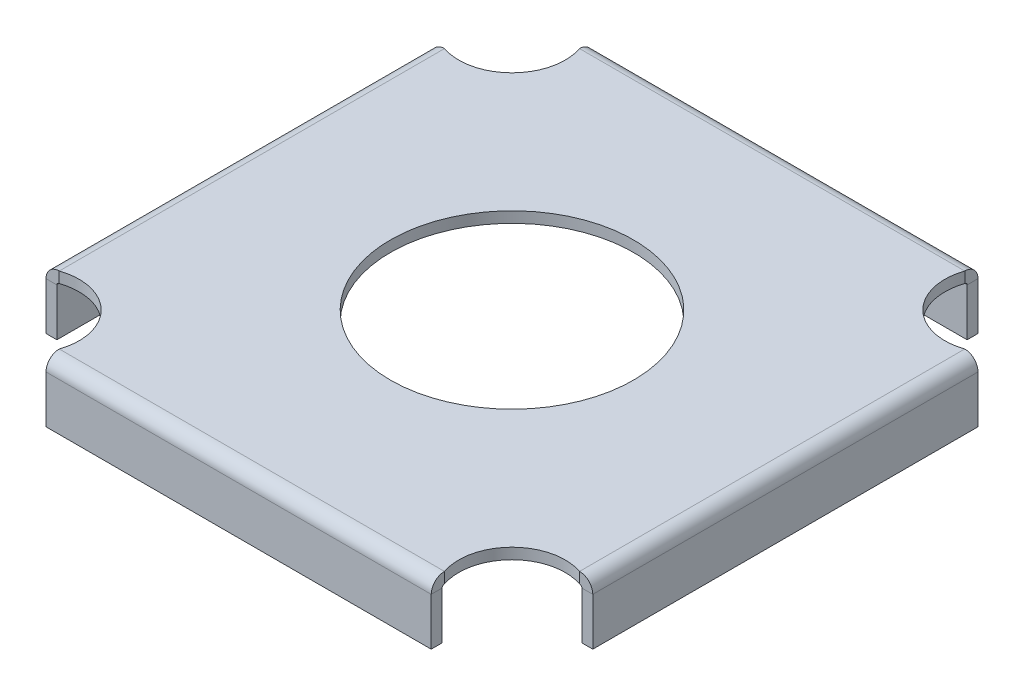
ISO-10303-21;
HEADER;
FILE_DESCRIPTION(('STEP AP214'),'2;1');
FILE_NAME('part.step','',(''),(''),'','','');
FILE_SCHEMA(('AUTOMOTIVE_DESIGN { 1 0 10303 214 1 1 1 1 }'));
ENDSEC;
DATA;
#1=APPLICATION_CONTEXT('core data for automotive mechanical design processes');
#2=APPLICATION_PROTOCOL_DEFINITION('international standard','automotive_design',2000,#1);
#3=PRODUCT_CONTEXT('',#1,'mechanical');
#4=PRODUCT('Part','Part','',(#3));
#5=PRODUCT_RELATED_PRODUCT_CATEGORY('part','',(#4));
#6=PRODUCT_DEFINITION_FORMATION('','',#4);
#7=PRODUCT_DEFINITION_CONTEXT('part definition',#1,'design');
#8=PRODUCT_DEFINITION('design','',#6,#7);
#9=PRODUCT_DEFINITION_SHAPE('','',#8);
#10=(LENGTH_UNIT() NAMED_UNIT(*) SI_UNIT(.MILLI.,.METRE.));
#11=(NAMED_UNIT(*) PLANE_ANGLE_UNIT() SI_UNIT($,.RADIAN.));
#12=(NAMED_UNIT(*) SI_UNIT($,.STERADIAN.) SOLID_ANGLE_UNIT());
#13=UNCERTAINTY_MEASURE_WITH_UNIT(LENGTH_MEASURE(1.E-05),#10,'distance_accuracy_value','');
#14=(GEOMETRIC_REPRESENTATION_CONTEXT(3) GLOBAL_UNCERTAINTY_ASSIGNED_CONTEXT((#13)) GLOBAL_UNIT_ASSIGNED_CONTEXT((#10,
#11,#12)) REPRESENTATION_CONTEXT('',''));
#15=CARTESIAN_POINT('',(0.,0.,0.));
#16=DIRECTION('',(0.,0.,1.));
#17=DIRECTION('',(1.,0.,0.));
#18=AXIS2_PLACEMENT_3D('',#15,#16,#17);
#19=CARTESIAN_POINT('',(76.2,-3.4163,76.2));
#20=DIRECTION('',(0.,1.,0.));
#21=DIRECTION('',(0.,0.,1.));
#22=AXIS2_PLACEMENT_3D('',#19,#20,#21);
#23=CYLINDRICAL_SURFACE('',#22,16.7005);
#24=CARTESIAN_POINT('',(76.2,0.,76.2));
#25=DIRECTION('',(0.,-1.,0.));
#26=DIRECTION('',(0.,0.,1.));
#27=AXIS2_PLACEMENT_3D('',#24,#25,#26);
#28=CIRCLE('',#27,16.7005);
#29=CARTESIAN_POINT('',(60.3828089759907,0.,81.5594));
#30=VERTEX_POINT('',#29);
#31=CARTESIAN_POINT('',(81.5594,0.,60.3828089759907));
#32=VERTEX_POINT('',#31);
#33=EDGE_CURVE('E538',#30,#32,#28,.T.);
#34=ORIENTED_EDGE('',*,*,#33,.F.);
#35=DIRECTION('',(0.,1.,0.));
#36=VECTOR('',#35,1.);
#37=CARTESIAN_POINT('',(60.3828089759907,-3.4163,81.5594));
#38=LINE('',#37,#36);
#39=CARTESIAN_POINT('',(60.3828089759907,-3.41629999999999,81.5594));
#40=VERTEX_POINT('',#39);
#41=EDGE_CURVE('E13',#40,#30,#38,.T.);
#42=ORIENTED_EDGE('',*,*,#41,.F.);
#43=CARTESIAN_POINT('',(76.2,-3.4163,76.2));
#44=DIRECTION('',(0.,-1.,0.));
#45=DIRECTION('',(0.,0.,1.));
#46=AXIS2_PLACEMENT_3D('',#43,#44,#45);
#47=CIRCLE('',#46,16.7005);
#48=CARTESIAN_POINT('',(81.5594,-3.4163,60.3828089759907));
#49=VERTEX_POINT('',#48);
#50=EDGE_CURVE('E542',#40,#49,#47,.T.);
#51=ORIENTED_EDGE('',*,*,#50,.T.);
#52=DIRECTION('',(0.,1.,0.));
#53=VECTOR('',#52,1.);
#54=CARTESIAN_POINT('',(81.5594,-3.4163,60.3828089759907));
#55=LINE('',#54,#53);
#56=EDGE_CURVE('E130',#49,#32,#55,.T.);
#57=ORIENTED_EDGE('',*,*,#56,.T.);
#58=EDGE_LOOP('',(#34,#42,#51,#57));
#59=FACE_BOUND('',#58,.T.);
#60=ADVANCED_FACE('F127',(#59),#23,.F.);
#61=CARTESIAN_POINT('',(-76.2,-3.4163,76.2));
#62=DIRECTION('',(0.,1.,0.));
#63=DIRECTION('',(0.,0.,1.));
#64=AXIS2_PLACEMENT_3D('',#61,#62,#63);
#65=CYLINDRICAL_SURFACE('',#64,16.7005);
#66=CARTESIAN_POINT('',(-76.2,0.,76.2));
#67=DIRECTION('',(0.,-1.,0.));
#68=DIRECTION('',(0.,0.,1.));
#69=AXIS2_PLACEMENT_3D('',#66,#67,#68);
#70=CIRCLE('',#69,16.7005);
#71=CARTESIAN_POINT('',(-81.5594,0.,60.3828089759907));
#72=VERTEX_POINT('',#71);
#73=CARTESIAN_POINT('',(-60.3828089759907,0.,81.5594));
#74=VERTEX_POINT('',#73);
#75=EDGE_CURVE('E594',#72,#74,#70,.T.);
#76=ORIENTED_EDGE('',*,*,#75,.F.);
#77=DIRECTION('',(0.,1.,0.));
#78=VECTOR('',#77,1.);
#79=CARTESIAN_POINT('',(-81.5594,-3.4163,60.3828089759907));
#80=LINE('',#79,#78);
#81=CARTESIAN_POINT('',(-81.5594,-3.4163,60.3828089759907));
#82=VERTEX_POINT('',#81);
#83=EDGE_CURVE('E604',#82,#72,#80,.T.);
#84=ORIENTED_EDGE('',*,*,#83,.F.);
#85=CARTESIAN_POINT('',(-76.2,-3.4163,76.2));
#86=DIRECTION('',(0.,-1.,0.));
#87=DIRECTION('',(0.,0.,1.));
#88=AXIS2_PLACEMENT_3D('',#85,#86,#87);
#89=CIRCLE('',#88,16.7005);
#90=CARTESIAN_POINT('',(-60.3828089759907,-3.41629999999999,81.5594));
#91=VERTEX_POINT('',#90);
#92=EDGE_CURVE('E564',#82,#91,#89,.T.);
#93=ORIENTED_EDGE('',*,*,#92,.T.);
#94=DIRECTION('',(0.,1.,0.));
#95=VECTOR('',#94,1.);
#96=CARTESIAN_POINT('',(-60.3828089759907,-3.4163,81.5594));
#97=LINE('',#96,#95);
#98=EDGE_CURVE('E136',#91,#74,#97,.T.);
#99=ORIENTED_EDGE('',*,*,#98,.T.);
#100=EDGE_LOOP('',(#76,#84,#93,#99));
#101=FACE_BOUND('',#100,.T.);
#102=ADVANCED_FACE('F642',(#101),#65,.F.);
#103=CARTESIAN_POINT('',(-76.2,-3.4163,-76.2));
#104=DIRECTION('',(0.,1.,0.));
#105=DIRECTION('',(0.,0.,1.));
#106=AXIS2_PLACEMENT_3D('',#103,#104,#105);
#107=CYLINDRICAL_SURFACE('',#106,16.7005);
#108=CARTESIAN_POINT('',(-76.2,0.,-76.2));
#109=DIRECTION('',(0.,-1.,0.));
#110=DIRECTION('',(0.,0.,1.));
#111=AXIS2_PLACEMENT_3D('',#108,#109,#110);
#112=CIRCLE('',#111,16.7005);
#113=CARTESIAN_POINT('',(-60.3828089759907,0.,-81.5594));
#114=VERTEX_POINT('',#113);
#115=CARTESIAN_POINT('',(-81.5594,0.,-60.3828089759907));
#116=VERTEX_POINT('',#115);
#117=EDGE_CURVE('E586',#114,#116,#112,.T.);
#118=ORIENTED_EDGE('',*,*,#117,.F.);
#119=DIRECTION('',(0.,1.,0.));
#120=VECTOR('',#119,1.);
#121=CARTESIAN_POINT('',(-60.3828089759907,-3.4163,-81.5594));
#122=LINE('',#121,#120);
#123=CARTESIAN_POINT('',(-60.3828089759907,-3.4163,-81.5594));
#124=VERTEX_POINT('',#123);
#125=EDGE_CURVE('E611',#124,#114,#122,.T.);
#126=ORIENTED_EDGE('',*,*,#125,.F.);
#127=CARTESIAN_POINT('',(-76.2,-3.4163,-76.2));
#128=DIRECTION('',(0.,-1.,0.));
#129=DIRECTION('',(0.,0.,1.));
#130=AXIS2_PLACEMENT_3D('',#127,#128,#129);
#131=CIRCLE('',#130,16.7005);
#132=CARTESIAN_POINT('',(-81.5594,-3.4163,-60.3828089759907));
#133=VERTEX_POINT('',#132);
#134=EDGE_CURVE('E557',#124,#133,#131,.T.);
#135=ORIENTED_EDGE('',*,*,#134,.T.);
#136=DIRECTION('',(0.,1.,0.));
#137=VECTOR('',#136,1.);
#138=CARTESIAN_POINT('',(-81.5594,-3.4163,-60.3828089759907));
#139=LINE('',#138,#137);
#140=EDGE_CURVE('E607',#133,#116,#139,.T.);
#141=ORIENTED_EDGE('',*,*,#140,.T.);
#142=EDGE_LOOP('',(#118,#126,#135,#141));
#143=FACE_BOUND('',#142,.T.);
#144=ADVANCED_FACE('F688',(#143),#107,.F.);
#145=CARTESIAN_POINT('',(76.2,-3.4163,-76.2));
#146=DIRECTION('',(0.,1.,0.));
#147=DIRECTION('',(0.,0.,1.));
#148=AXIS2_PLACEMENT_3D('',#145,#146,#147);
#149=CYLINDRICAL_SURFACE('',#148,16.7005);
#150=CARTESIAN_POINT('',(76.2,0.,-76.2));
#151=DIRECTION('',(0.,-1.,0.));
#152=DIRECTION('',(0.,0.,1.));
#153=AXIS2_PLACEMENT_3D('',#150,#151,#152);
#154=CIRCLE('',#153,16.7005);
#155=CARTESIAN_POINT('',(81.5594,0.,-60.3828089759907));
#156=VERTEX_POINT('',#155);
#157=CARTESIAN_POINT('',(60.3828089759907,0.,-81.5594));
#158=VERTEX_POINT('',#157);
#159=EDGE_CURVE('E578',#156,#158,#154,.T.);
#160=ORIENTED_EDGE('',*,*,#159,.F.);
#161=DIRECTION('',(0.,1.,0.));
#162=VECTOR('',#161,1.);
#163=CARTESIAN_POINT('',(81.5594,-3.4163,-60.3828089759907));
#164=LINE('',#163,#162);
#165=CARTESIAN_POINT('',(81.5594,-3.4163,-60.3828089759907));
#166=VERTEX_POINT('',#165);
#167=EDGE_CURVE('E618',#166,#156,#164,.T.);
#168=ORIENTED_EDGE('',*,*,#167,.F.);
#169=CARTESIAN_POINT('',(76.2,-3.4163,-76.2));
#170=DIRECTION('',(0.,-1.,0.));
#171=DIRECTION('',(0.,0.,1.));
#172=AXIS2_PLACEMENT_3D('',#169,#170,#171);
#173=CIRCLE('',#172,16.7005);
#174=CARTESIAN_POINT('',(60.3828089759907,-3.4163,-81.5594));
#175=VERTEX_POINT('',#174);
#176=EDGE_CURVE('E550',#166,#175,#173,.T.);
#177=ORIENTED_EDGE('',*,*,#176,.T.);
#178=DIRECTION('',(0.,1.,0.));
#179=VECTOR('',#178,1.);
#180=CARTESIAN_POINT('',(60.3828089759907,-3.4163,-81.5594));
#181=LINE('',#180,#179);
#182=EDGE_CURVE('E615',#175,#158,#181,.T.);
#183=ORIENTED_EDGE('',*,*,#182,.T.);
#184=EDGE_LOOP('',(#160,#168,#177,#183));
#185=FACE_BOUND('',#184,.T.);
#186=ADVANCED_FACE('F693',(#185),#149,.F.);
#187=CARTESIAN_POINT('',(76.2,-3.4163,76.2));
#188=DIRECTION('',(0.,1.,0.));
#189=DIRECTION('',(0.,0.,1.));
#190=AXIS2_PLACEMENT_3D('',#187,#188,#189);
#191=PLANE('',#190);
#192=CARTESIAN_POINT('',(0.,-3.4163,0.));
#193=DIRECTION('',(0.,1.,0.));
#194=DIRECTION('',(0.,0.,1.));
#195=AXIS2_PLACEMENT_3D('',#192,#193,#194);
#196=CIRCLE('',#195,38.1);
#197=CARTESIAN_POINT('',(0.,-3.4163,38.1));
#198=VERTEX_POINT('',#197);
#199=EDGE_CURVE('E534',#198,#198,#196,.T.);
#200=ORIENTED_EDGE('',*,*,#199,.T.);
#201=EDGE_LOOP('',(#200));
#202=FACE_BOUND('',#201,.T.);
#203=ORIENTED_EDGE('',*,*,#50,.F.);
#204=DIRECTION('',(1.,0.,0.));
#205=VECTOR('',#204,1.);
#206=CARTESIAN_POINT('',(60.3828089759907,-3.4163,81.5594));
#207=LINE('',#206,#205);
#208=EDGE_CURVE('E568',#91,#40,#207,.T.);
#209=ORIENTED_EDGE('',*,*,#208,.F.);
#210=ORIENTED_EDGE('',*,*,#92,.F.);
#211=DIRECTION('',(0.,0.,1.));
#212=VECTOR('',#211,1.);
#213=CARTESIAN_POINT('',(-81.5594,-3.4163,60.3828089759907));
#214=LINE('',#213,#212);
#215=EDGE_CURVE('E561',#133,#82,#214,.T.);
#216=ORIENTED_EDGE('',*,*,#215,.F.);
#217=ORIENTED_EDGE('',*,*,#134,.F.);
#218=DIRECTION('',(-1.,0.,0.));
#219=VECTOR('',#218,1.);
#220=CARTESIAN_POINT('',(-60.3828089759907,-3.4163,-81.5594));
#221=LINE('',#220,#219);
#222=EDGE_CURVE('E554',#175,#124,#221,.T.);
#223=ORIENTED_EDGE('',*,*,#222,.F.);
#224=ORIENTED_EDGE('',*,*,#176,.F.);
#225=DIRECTION('',(0.,0.,-1.));
#226=VECTOR('',#225,1.);
#227=CARTESIAN_POINT('',(81.5594,-3.4163,-60.3828089759907));
#228=LINE('',#227,#226);
#229=EDGE_CURVE('E546',#49,#166,#228,.T.);
#230=ORIENTED_EDGE('',*,*,#229,.F.);
#231=EDGE_LOOP('',(#203,#209,#210,#216,#217,#223,#224,#230));
#232=FACE_BOUND('',#231,.T.);
#233=ADVANCED_FACE('F648',(#202,#232),#191,.F.);
#234=CARTESIAN_POINT('',(76.2,0.,76.2));
#235=DIRECTION('',(0.,1.,0.));
#236=DIRECTION('',(0.,0.,1.));
#237=AXIS2_PLACEMENT_3D('',#234,#235,#236);
#238=PLANE('',#237);
#239=CARTESIAN_POINT('',(0.,0.,0.));
#240=DIRECTION('',(0.,1.,0.));
#241=DIRECTION('',(0.,0.,1.));
#242=AXIS2_PLACEMENT_3D('',#239,#240,#241);
#243=CIRCLE('',#242,38.1);
#244=CARTESIAN_POINT('',(0.,0.,38.1));
#245=VERTEX_POINT('',#244);
#246=EDGE_CURVE('E522',#245,#245,#243,.T.);
#247=ORIENTED_EDGE('',*,*,#246,.F.);
#248=EDGE_LOOP('',(#247));
#249=FACE_BOUND('',#248,.T.);
#250=ORIENTED_EDGE('',*,*,#33,.T.);
#251=DIRECTION('',(0.,0.,-1.));
#252=VECTOR('',#251,1.);
#253=CARTESIAN_POINT('',(81.5594,0.,-60.3828089759907));
#254=LINE('',#253,#252);
#255=EDGE_CURVE('E574',#32,#156,#254,.T.);
#256=ORIENTED_EDGE('',*,*,#255,.T.);
#257=ORIENTED_EDGE('',*,*,#159,.T.);
#258=DIRECTION('',(-1.,0.,0.));
#259=VECTOR('',#258,1.);
#260=CARTESIAN_POINT('',(-60.3828089759907,0.,-81.5594));
#261=LINE('',#260,#259);
#262=EDGE_CURVE('E582',#158,#114,#261,.T.);
#263=ORIENTED_EDGE('',*,*,#262,.T.);
#264=ORIENTED_EDGE('',*,*,#117,.T.);
#265=DIRECTION('',(0.,0.,1.));
#266=VECTOR('',#265,1.);
#267=CARTESIAN_POINT('',(-81.5594,0.,60.3828089759907));
#268=LINE('',#267,#266);
#269=EDGE_CURVE('E590',#116,#72,#268,.T.);
#270=ORIENTED_EDGE('',*,*,#269,.T.);
#271=ORIENTED_EDGE('',*,*,#75,.T.);
#272=DIRECTION('',(1.,0.,0.));
#273=VECTOR('',#272,1.);
#274=CARTESIAN_POINT('',(60.3828089759907,0.,81.5594));
#275=LINE('',#274,#273);
#276=EDGE_CURVE('E547',#74,#30,#275,.T.);
#277=ORIENTED_EDGE('',*,*,#276,.T.);
#278=EDGE_LOOP('',(#250,#256,#257,#263,#264,#270,#271,#277));
#279=FACE_BOUND('',#278,.T.);
#280=ADVANCED_FACE('F634',(#249,#279),#238,.T.);
#281=CARTESIAN_POINT('',(0.,-3.4163,0.));
#282=DIRECTION('',(0.,1.,0.));
#283=DIRECTION('',(0.,0.,1.));
#284=AXIS2_PLACEMENT_3D('',#281,#282,#283);
#285=CYLINDRICAL_SURFACE('',#284,38.1);
#286=ORIENTED_EDGE('',*,*,#199,.F.);
#287=EDGE_LOOP('',(#286));
#288=FACE_BOUND('',#287,.T.);
#289=ORIENTED_EDGE('',*,*,#246,.T.);
#290=EDGE_LOOP('',(#289));
#291=FACE_BOUND('',#290,.T.);
#292=ADVANCED_FACE('F807',(#288,#291),#285,.F.);
#293=CARTESIAN_POINT('',(60.3828089759907,-4.15289999999999,81.5594));
#294=DIRECTION('',(1.,0.,0.));
#295=DIRECTION('',(0.,0.,-1.));
#296=AXIS2_PLACEMENT_3D('',#293,#294,#295);
#297=PLANE('',#296);
#298=DIRECTION('',(0.,0.,1.));
#299=VECTOR('',#298,1.);
#300=CARTESIAN_POINT('',(60.3828089759907,-4.1529,85.7123));
#301=LINE('',#300,#299);
#302=CARTESIAN_POINT('',(60.3828089759907,-4.15289999999999,82.296));
#303=VERTEX_POINT('',#302);
#304=CARTESIAN_POINT('',(60.3828089759907,-4.15289999999998,85.7123));
#305=VERTEX_POINT('',#304);
#306=EDGE_CURVE('E464',#303,#305,#301,.T.);
#307=ORIENTED_EDGE('',*,*,#306,.F.);
#308=CARTESIAN_POINT('',(60.3828089759907,-4.15289999999999,81.5594));
#309=DIRECTION('',(-1.,0.,0.));
#310=DIRECTION('',(0.,0.,1.));
#311=AXIS2_PLACEMENT_3D('',#308,#309,#310);
#312=CIRCLE('',#311,0.736600000000004);
#313=EDGE_CURVE('E527',#40,#303,#312,.F.);
#314=ORIENTED_EDGE('',*,*,#313,.F.);
#315=ORIENTED_EDGE('',*,*,#41,.T.);
#316=CARTESIAN_POINT('',(60.3828089759907,-4.15289999999999,81.5594));
#317=DIRECTION('',(-1.,0.,0.));
#318=DIRECTION('',(0.,0.,1.));
#319=AXIS2_PLACEMENT_3D('',#316,#317,#318);
#320=CIRCLE('',#319,4.1529);
#321=EDGE_CURVE('E144',#30,#305,#320,.F.);
#322=ORIENTED_EDGE('',*,*,#321,.T.);
#323=EDGE_LOOP('',(#307,#314,#315,#322));
#324=FACE_BOUND('',#323,.T.);
#325=ADVANCED_FACE('F655',(#324),#297,.T.);
#326=CARTESIAN_POINT('',(-60.3828089759907,-4.15289999999999,81.5594));
#327=DIRECTION('',(1.,0.,0.));
#328=DIRECTION('',(0.,0.,-1.));
#329=AXIS2_PLACEMENT_3D('',#326,#327,#328);
#330=PLANE('',#329);
#331=CARTESIAN_POINT('',(-60.3828089759907,-4.15289999999999,81.5594));
#332=DIRECTION('',(-1.,0.,0.));
#333=DIRECTION('',(0.,0.,1.));
#334=AXIS2_PLACEMENT_3D('',#331,#332,#333);
#335=CIRCLE('',#334,0.736600000000004);
#336=CARTESIAN_POINT('',(-60.3828089759907,-4.15289999999999,82.296));
#337=VERTEX_POINT('',#336);
#338=EDGE_CURVE('E479',#337,#91,#335,.T.);
#339=ORIENTED_EDGE('',*,*,#338,.F.);
#340=DIRECTION('',(0.,0.,1.));
#341=VECTOR('',#340,1.);
#342=CARTESIAN_POINT('',(-60.3828089759907,-4.15289999999999,82.296));
#343=LINE('',#342,#341);
#344=CARTESIAN_POINT('',(-60.3828089759907,-4.15289999999999,85.7123));
#345=VERTEX_POINT('',#344);
#346=EDGE_CURVE('E510',#337,#345,#343,.T.);
#347=ORIENTED_EDGE('',*,*,#346,.T.);
#348=CARTESIAN_POINT('',(-60.3828089759907,-4.15289999999999,81.5594));
#349=DIRECTION('',(-1.,0.,0.));
#350=DIRECTION('',(0.,0.,1.));
#351=AXIS2_PLACEMENT_3D('',#348,#349,#350);
#352=CIRCLE('',#351,4.1529);
#353=EDGE_CURVE('E523',#345,#74,#352,.T.);
#354=ORIENTED_EDGE('',*,*,#353,.T.);
#355=ORIENTED_EDGE('',*,*,#98,.F.);
#356=EDGE_LOOP('',(#339,#347,#354,#355));
#357=FACE_BOUND('',#356,.T.);
#358=ADVANCED_FACE('F639',(#357),#330,.F.);
#359=CARTESIAN_POINT('',(-60.3828089759907,-4.15289999999999,81.5594));
#360=DIRECTION('',(-1.,0.,0.));
#361=DIRECTION('',(0.,0.,1.));
#362=AXIS2_PLACEMENT_3D('',#359,#360,#361);
#363=CYLINDRICAL_SURFACE('',#362,4.1529);
#364=ORIENTED_EDGE('',*,*,#276,.F.);
#365=ORIENTED_EDGE('',*,*,#353,.F.);
#366=DIRECTION('',(-1.,0.,0.));
#367=VECTOR('',#366,1.);
#368=CARTESIAN_POINT('',(0.,-4.15289999999999,85.7123));
#369=LINE('',#368,#367);
#370=EDGE_CURVE('E506',#305,#345,#369,.T.);
#371=ORIENTED_EDGE('',*,*,#370,.F.);
#372=ORIENTED_EDGE('',*,*,#321,.F.);
#373=EDGE_LOOP('',(#364,#365,#371,#372));
#374=FACE_BOUND('',#373,.T.);
#375=ADVANCED_FACE('F636',(#374),#363,.T.);
#376=CARTESIAN_POINT('',(-60.3828089759907,-4.15289999999999,81.5594));
#377=DIRECTION('',(-1.,0.,0.));
#378=DIRECTION('',(0.,0.,1.));
#379=AXIS2_PLACEMENT_3D('',#376,#377,#378);
#380=CYLINDRICAL_SURFACE('',#379,0.736600000000004);
#381=ORIENTED_EDGE('',*,*,#208,.T.);
#382=ORIENTED_EDGE('',*,*,#313,.T.);
#383=DIRECTION('',(1.,0.,0.));
#384=VECTOR('',#383,1.);
#385=CARTESIAN_POINT('',(60.3828089759907,-4.1529,82.296));
#386=LINE('',#385,#384);
#387=EDGE_CURVE('E514',#303,#337,#386,.F.);
#388=ORIENTED_EDGE('',*,*,#387,.T.);
#389=ORIENTED_EDGE('',*,*,#338,.T.);
#390=EDGE_LOOP('',(#381,#382,#388,#389));
#391=FACE_BOUND('',#390,.T.);
#392=ADVANCED_FACE('F652',(#391),#380,.F.);
#393=CARTESIAN_POINT('',(-60.3828089759907,-3.41629999999999,85.7123));
#394=DIRECTION('',(-1.,0.,0.));
#395=DIRECTION('',(0.,0.,1.));
#396=AXIS2_PLACEMENT_3D('',#393,#394,#395);
#397=PLANE('',#396);
#398=DIRECTION('',(0.,1.,0.));
#399=VECTOR('',#398,1.);
#400=CARTESIAN_POINT('',(-60.3828089759907,-3.41629999999999,85.7123));
#401=LINE('',#400,#399);
#402=CARTESIAN_POINT('',(-60.3828089759907,-19.05,85.7123));
#403=VERTEX_POINT('',#402);
#404=EDGE_CURVE('E484',#403,#345,#401,.T.);
#405=ORIENTED_EDGE('',*,*,#404,.T.);
#406=ORIENTED_EDGE('',*,*,#346,.F.);
#407=DIRECTION('',(0.,-1.,0.));
#408=VECTOR('',#407,1.);
#409=CARTESIAN_POINT('',(-60.3828089759907,2.17196961742773E-13,82.296));
#410=LINE('',#409,#408);
#411=CARTESIAN_POINT('',(-60.3828089759907,-19.05,82.296));
#412=VERTEX_POINT('',#411);
#413=EDGE_CURVE('E495',#412,#337,#410,.F.);
#414=ORIENTED_EDGE('',*,*,#413,.F.);
#415=DIRECTION('',(0.,0.,-1.));
#416=VECTOR('',#415,1.);
#417=CARTESIAN_POINT('',(-60.3828089759907,-19.05,85.7123));
#418=LINE('',#417,#416);
#419=EDGE_CURVE('E476',#403,#412,#418,.T.);
#420=ORIENTED_EDGE('',*,*,#419,.F.);
#421=EDGE_LOOP('',(#405,#406,#414,#420));
#422=FACE_BOUND('',#421,.T.);
#423=ADVANCED_FACE('F672',(#422),#397,.T.);
#424=CARTESIAN_POINT('',(60.3828089759907,-19.05,85.7123));
#425=DIRECTION('',(1.,0.,0.));
#426=DIRECTION('',(0.,0.,-1.));
#427=AXIS2_PLACEMENT_3D('',#424,#425,#426);
#428=PLANE('',#427);
#429=DIRECTION('',(0.,1.,0.));
#430=VECTOR('',#429,1.);
#431=CARTESIAN_POINT('',(60.3828089759907,2.17196961742773E-13,82.296));
#432=LINE('',#431,#430);
#433=CARTESIAN_POINT('',(60.3828089759907,-19.05,82.296));
#434=VERTEX_POINT('',#433);
#435=EDGE_CURVE('E503',#303,#434,#432,.F.);
#436=ORIENTED_EDGE('',*,*,#435,.F.);
#437=ORIENTED_EDGE('',*,*,#306,.T.);
#438=DIRECTION('',(0.,-1.,0.));
#439=VECTOR('',#438,1.);
#440=CARTESIAN_POINT('',(60.3828089759907,-19.05,85.7123));
#441=LINE('',#440,#439);
#442=CARTESIAN_POINT('',(60.3828089759907,-19.05,85.7123));
#443=VERTEX_POINT('',#442);
#444=EDGE_CURVE('E492',#305,#443,#441,.T.);
#445=ORIENTED_EDGE('',*,*,#444,.T.);
#446=DIRECTION('',(0.,0.,-1.));
#447=VECTOR('',#446,1.);
#448=CARTESIAN_POINT('',(60.3828089759907,-19.05,85.7123));
#449=LINE('',#448,#447);
#450=EDGE_CURVE('E480',#443,#434,#449,.T.);
#451=ORIENTED_EDGE('',*,*,#450,.T.);
#452=EDGE_LOOP('',(#436,#437,#445,#451));
#453=FACE_BOUND('',#452,.T.);
#454=ADVANCED_FACE('F659',(#453),#428,.T.);
#455=CARTESIAN_POINT('',(0.,2.29124909440662E-13,85.7123));
#456=DIRECTION('',(0.,0.,1.));
#457=DIRECTION('',(0.,-1.,0.));
#458=AXIS2_PLACEMENT_3D('',#455,#456,#457);
#459=PLANE('',#458);
#460=ORIENTED_EDGE('',*,*,#444,.F.);
#461=ORIENTED_EDGE('',*,*,#370,.T.);
#462=ORIENTED_EDGE('',*,*,#404,.F.);
#463=DIRECTION('',(-1.,0.,0.));
#464=VECTOR('',#463,1.);
#465=CARTESIAN_POINT('',(-60.3828089759907,-19.05,85.7123));
#466=LINE('',#465,#464);
#467=EDGE_CURVE('E488',#443,#403,#466,.T.);
#468=ORIENTED_EDGE('',*,*,#467,.F.);
#469=EDGE_LOOP('',(#460,#461,#462,#468));
#470=FACE_BOUND('',#469,.T.);
#471=ADVANCED_FACE('F663',(#470),#459,.T.);
#472=CARTESIAN_POINT('',(0.,2.17196961742773E-13,82.296));
#473=DIRECTION('',(0.,0.,1.));
#474=DIRECTION('',(0.,-1.,0.));
#475=AXIS2_PLACEMENT_3D('',#472,#473,#474);
#476=PLANE('',#475);
#477=ORIENTED_EDGE('',*,*,#387,.F.);
#478=ORIENTED_EDGE('',*,*,#435,.T.);
#479=DIRECTION('',(1.,0.,0.));
#480=VECTOR('',#479,1.);
#481=CARTESIAN_POINT('',(0.,-19.05,82.296));
#482=LINE('',#481,#480);
#483=EDGE_CURVE('E499',#434,#412,#482,.F.);
#484=ORIENTED_EDGE('',*,*,#483,.T.);
#485=ORIENTED_EDGE('',*,*,#413,.T.);
#486=EDGE_LOOP('',(#477,#478,#484,#485));
#487=FACE_BOUND('',#486,.T.);
#488=ADVANCED_FACE('F670',(#487),#476,.F.);
#489=CARTESIAN_POINT('',(-60.3828089759907,-19.05,85.7123));
#490=DIRECTION('',(0.,-1.,0.));
#491=DIRECTION('',(0.,0.,-1.));
#492=AXIS2_PLACEMENT_3D('',#489,#490,#491);
#493=PLANE('',#492);
#494=ORIENTED_EDGE('',*,*,#483,.F.);
#495=ORIENTED_EDGE('',*,*,#450,.F.);
#496=ORIENTED_EDGE('',*,*,#467,.T.);
#497=ORIENTED_EDGE('',*,*,#419,.T.);
#498=EDGE_LOOP('',(#494,#495,#496,#497));
#499=FACE_BOUND('',#498,.T.);
#500=ADVANCED_FACE('F667',(#499),#493,.T.);
#501=CARTESIAN_POINT('',(81.5594,-4.1529,-60.3828089759907));
#502=DIRECTION('',(0.,0.,-1.));
#503=DIRECTION('',(-1.,0.,0.));
#504=AXIS2_PLACEMENT_3D('',#501,#502,#503);
#505=PLANE('',#504);
#506=DIRECTION('',(1.,0.,0.));
#507=VECTOR('',#506,1.);
#508=CARTESIAN_POINT('',(85.7123,-4.15289999999999,-60.3828089759907));
#509=LINE('',#508,#507);
#510=CARTESIAN_POINT('',(82.296,-4.1529,-60.3828089759907));
#511=VERTEX_POINT('',#510);
#512=CARTESIAN_POINT('',(85.7123,-4.15289999999999,-60.3828089759907));
#513=VERTEX_POINT('',#512);
#514=EDGE_CURVE('E405',#511,#513,#509,.T.);
#515=ORIENTED_EDGE('',*,*,#514,.F.);
#516=CARTESIAN_POINT('',(81.5594,-4.1529,-60.3828089759907));
#517=DIRECTION('',(0.,0.,1.));
#518=DIRECTION('',(1.,0.,0.));
#519=AXIS2_PLACEMENT_3D('',#516,#517,#518);
#520=CIRCLE('',#519,0.736600000000004);
#521=EDGE_CURVE('E469',#166,#511,#520,.F.);
#522=ORIENTED_EDGE('',*,*,#521,.F.);
#523=ORIENTED_EDGE('',*,*,#167,.T.);
#524=CARTESIAN_POINT('',(81.5594,-4.1529,-60.3828089759907));
#525=DIRECTION('',(0.,0.,1.));
#526=DIRECTION('',(1.,0.,0.));
#527=AXIS2_PLACEMENT_3D('',#524,#525,#526);
#528=CIRCLE('',#527,4.1529);
#529=EDGE_CURVE('E460',#156,#513,#528,.F.);
#530=ORIENTED_EDGE('',*,*,#529,.T.);
#531=EDGE_LOOP('',(#515,#522,#523,#530));
#532=FACE_BOUND('',#531,.T.);
#533=ADVANCED_FACE('F790',(#532),#505,.T.);
#534=CARTESIAN_POINT('',(81.5594,-4.1529,60.3828089759907));
#535=DIRECTION('',(0.,0.,-1.));
#536=DIRECTION('',(-1.,0.,0.));
#537=AXIS2_PLACEMENT_3D('',#534,#535,#536);
#538=PLANE('',#537);
#539=CARTESIAN_POINT('',(81.5594,-4.1529,60.3828089759907));
#540=DIRECTION('',(0.,0.,1.));
#541=DIRECTION('',(1.,0.,0.));
#542=AXIS2_PLACEMENT_3D('',#539,#540,#541);
#543=CIRCLE('',#542,0.736600000000004);
#544=CARTESIAN_POINT('',(82.296,-4.1529,60.3828089759907));
#545=VERTEX_POINT('',#544);
#546=EDGE_CURVE('E420',#545,#49,#543,.T.);
#547=ORIENTED_EDGE('',*,*,#546,.F.);
#548=DIRECTION('',(1.,0.,0.));
#549=VECTOR('',#548,1.);
#550=CARTESIAN_POINT('',(82.296,-4.1529,60.3828089759907));
#551=LINE('',#550,#549);
#552=CARTESIAN_POINT('',(85.7123,-4.15289999999999,60.3828089759907));
#553=VERTEX_POINT('',#552);
#554=EDGE_CURVE('E450',#545,#553,#551,.T.);
#555=ORIENTED_EDGE('',*,*,#554,.T.);
#556=CARTESIAN_POINT('',(81.5594,-4.1529,60.3828089759907));
#557=DIRECTION('',(0.,0.,1.));
#558=DIRECTION('',(1.,0.,0.));
#559=AXIS2_PLACEMENT_3D('',#556,#557,#558);
#560=CIRCLE('',#559,4.1529);
#561=EDGE_CURVE('E465',#553,#32,#560,.T.);
#562=ORIENTED_EDGE('',*,*,#561,.T.);
#563=ORIENTED_EDGE('',*,*,#56,.F.);
#564=EDGE_LOOP('',(#547,#555,#562,#563));
#565=FACE_BOUND('',#564,.T.);
#566=ADVANCED_FACE('F785',(#565),#538,.F.);
#567=CARTESIAN_POINT('',(81.5594,-4.1529,60.3828089759907));
#568=DIRECTION('',(0.,0.,1.));
#569=DIRECTION('',(1.,0.,0.));
#570=AXIS2_PLACEMENT_3D('',#567,#568,#569);
#571=CYLINDRICAL_SURFACE('',#570,4.1529);
#572=ORIENTED_EDGE('',*,*,#255,.F.);
#573=ORIENTED_EDGE('',*,*,#561,.F.);
#574=DIRECTION('',(0.,0.,1.));
#575=VECTOR('',#574,1.);
#576=CARTESIAN_POINT('',(85.7123,-4.15289999999999,-60.3828089759907));
#577=LINE('',#576,#575);
#578=EDGE_CURVE('E447',#553,#513,#577,.F.);
#579=ORIENTED_EDGE('',*,*,#578,.T.);
#580=ORIENTED_EDGE('',*,*,#529,.F.);
#581=EDGE_LOOP('',(#572,#573,#579,#580));
#582=FACE_BOUND('',#581,.T.);
#583=ADVANCED_FACE('F782',(#582),#571,.T.);
#584=CARTESIAN_POINT('',(81.5594,-4.1529,60.3828089759907));
#585=DIRECTION('',(0.,0.,1.));
#586=DIRECTION('',(1.,0.,0.));
#587=AXIS2_PLACEMENT_3D('',#584,#585,#586);
#588=CYLINDRICAL_SURFACE('',#587,0.736600000000004);
#589=ORIENTED_EDGE('',*,*,#229,.T.);
#590=ORIENTED_EDGE('',*,*,#521,.T.);
#591=DIRECTION('',(0.,0.,1.));
#592=VECTOR('',#591,1.);
#593=CARTESIAN_POINT('',(82.296,-4.1529,-60.3828089759907));
#594=LINE('',#593,#592);
#595=EDGE_CURVE('E454',#511,#545,#594,.T.);
#596=ORIENTED_EDGE('',*,*,#595,.T.);
#597=ORIENTED_EDGE('',*,*,#546,.T.);
#598=EDGE_LOOP('',(#589,#590,#596,#597));
#599=FACE_BOUND('',#598,.T.);
#600=ADVANCED_FACE('F780',(#599),#588,.F.);
#601=CARTESIAN_POINT('',(85.7123,-3.41629999999999,-60.3828089759907));
#602=DIRECTION('',(0.,0.,-1.));
#603=DIRECTION('',(-1.,0.,0.));
#604=AXIS2_PLACEMENT_3D('',#601,#602,#603);
#605=PLANE('',#604);
#606=DIRECTION('',(0.,-1.,0.));
#607=VECTOR('',#606,1.);
#608=CARTESIAN_POINT('',(82.296,2.89595948990363E-13,-60.3828089759907));
#609=LINE('',#608,#607);
#610=CARTESIAN_POINT('',(82.2960000000001,-19.05,-60.3828089759907));
#611=VERTEX_POINT('',#610);
#612=EDGE_CURVE('E444',#511,#611,#609,.T.);
#613=ORIENTED_EDGE('',*,*,#612,.F.);
#614=ORIENTED_EDGE('',*,*,#514,.T.);
#615=DIRECTION('',(0.,1.,0.));
#616=VECTOR('',#615,1.);
#617=CARTESIAN_POINT('',(85.7123,-3.41629999999999,-60.3828089759907));
#618=LINE('',#617,#616);
#619=CARTESIAN_POINT('',(85.7123000000001,-19.05,-60.3828089759907));
#620=VERTEX_POINT('',#619);
#621=EDGE_CURVE('E433',#513,#620,#618,.F.);
#622=ORIENTED_EDGE('',*,*,#621,.T.);
#623=DIRECTION('',(-1.,0.,0.));
#624=VECTOR('',#623,1.);
#625=CARTESIAN_POINT('',(85.7123000000001,-19.05,-60.3828089759907));
#626=LINE('',#625,#624);
#627=EDGE_CURVE('E421',#620,#611,#626,.T.);
#628=ORIENTED_EDGE('',*,*,#627,.T.);
#629=EDGE_LOOP('',(#613,#614,#622,#628));
#630=FACE_BOUND('',#629,.T.);
#631=ADVANCED_FACE('F773',(#630),#605,.T.);
#632=CARTESIAN_POINT('',(85.7123000000001,-19.05,60.3828089759907));
#633=DIRECTION('',(0.,0.,1.));
#634=DIRECTION('',(0.,-1.,0.));
#635=AXIS2_PLACEMENT_3D('',#632,#633,#634);
#636=PLANE('',#635);
#637=DIRECTION('',(0.,-1.,0.));
#638=VECTOR('',#637,1.);
#639=CARTESIAN_POINT('',(85.7123000000001,-19.05,60.3828089759907));
#640=LINE('',#639,#638);
#641=CARTESIAN_POINT('',(85.7123000000001,-19.05,60.3828089759907));
#642=VERTEX_POINT('',#641);
#643=EDGE_CURVE('E425',#642,#553,#640,.F.);
#644=ORIENTED_EDGE('',*,*,#643,.T.);
#645=ORIENTED_EDGE('',*,*,#554,.F.);
#646=DIRECTION('',(0.,1.,0.));
#647=VECTOR('',#646,1.);
#648=CARTESIAN_POINT('',(82.296,3.16396380436809E-13,60.3828089759907));
#649=LINE('',#648,#647);
#650=CARTESIAN_POINT('',(82.2960000000001,-19.05,60.3828089759907));
#651=VERTEX_POINT('',#650);
#652=EDGE_CURVE('E436',#651,#545,#649,.T.);
#653=ORIENTED_EDGE('',*,*,#652,.F.);
#654=DIRECTION('',(-1.,0.,0.));
#655=VECTOR('',#654,1.);
#656=CARTESIAN_POINT('',(85.7123000000001,-19.05,60.3828089759907));
#657=LINE('',#656,#655);
#658=EDGE_CURVE('E417',#642,#651,#657,.T.);
#659=ORIENTED_EDGE('',*,*,#658,.F.);
#660=EDGE_LOOP('',(#644,#645,#653,#659));
#661=FACE_BOUND('',#660,.T.);
#662=ADVANCED_FACE('F766',(#661),#636,.T.);
#663=CARTESIAN_POINT('',(85.7123,3.01523896688253E-13,0.));
#664=DIRECTION('',(-1.,0.,0.));
#665=DIRECTION('',(0.,-1.,0.));
#666=AXIS2_PLACEMENT_3D('',#663,#664,#665);
#667=PLANE('',#666);
#668=ORIENTED_EDGE('',*,*,#578,.F.);
#669=ORIENTED_EDGE('',*,*,#643,.F.);
#670=DIRECTION('',(0.,0.,-1.));
#671=VECTOR('',#670,1.);
#672=CARTESIAN_POINT('',(85.7123000000001,-19.05,-60.3828089759907));
#673=LINE('',#672,#671);
#674=EDGE_CURVE('E429',#620,#642,#673,.F.);
#675=ORIENTED_EDGE('',*,*,#674,.F.);
#676=ORIENTED_EDGE('',*,*,#621,.F.);
#677=EDGE_LOOP('',(#668,#669,#675,#676));
#678=FACE_BOUND('',#677,.T.);
#679=ADVANCED_FACE('F762',(#678),#667,.F.);
#680=CARTESIAN_POINT('',(82.296,2.89595948990363E-13,0.));
#681=DIRECTION('',(-1.,0.,0.));
#682=DIRECTION('',(0.,-1.,0.));
#683=AXIS2_PLACEMENT_3D('',#680,#681,#682);
#684=PLANE('',#683);
#685=ORIENTED_EDGE('',*,*,#652,.T.);
#686=ORIENTED_EDGE('',*,*,#595,.F.);
#687=ORIENTED_EDGE('',*,*,#612,.T.);
#688=DIRECTION('',(0.,0.,1.));
#689=VECTOR('',#688,1.);
#690=CARTESIAN_POINT('',(82.2960000000001,-19.05,0.));
#691=LINE('',#690,#689);
#692=EDGE_CURVE('E440',#611,#651,#691,.T.);
#693=ORIENTED_EDGE('',*,*,#692,.T.);
#694=EDGE_LOOP('',(#685,#686,#687,#693));
#695=FACE_BOUND('',#694,.T.);
#696=ADVANCED_FACE('F765',(#695),#684,.T.);
#697=CARTESIAN_POINT('',(85.7123000000001,-19.05,-60.3828089759907));
#698=DIRECTION('',(0.,-1.,0.));
#699=DIRECTION('',(1.,0.,0.));
#700=AXIS2_PLACEMENT_3D('',#697,#698,#699);
#701=PLANE('',#700);
#702=ORIENTED_EDGE('',*,*,#692,.F.);
#703=ORIENTED_EDGE('',*,*,#627,.F.);
#704=ORIENTED_EDGE('',*,*,#674,.T.);
#705=ORIENTED_EDGE('',*,*,#658,.T.);
#706=EDGE_LOOP('',(#702,#703,#704,#705));
#707=FACE_BOUND('',#706,.T.);
#708=ADVANCED_FACE('F759',(#707),#701,.T.);
#709=CARTESIAN_POINT('',(-60.3828089759907,-4.15290000000001,-81.5594));
#710=DIRECTION('',(-1.,0.,0.));
#711=DIRECTION('',(0.,0.,1.));
#712=AXIS2_PLACEMENT_3D('',#709,#710,#711);
#713=PLANE('',#712);
#714=DIRECTION('',(0.,0.,-1.));
#715=VECTOR('',#714,1.);
#716=CARTESIAN_POINT('',(-60.3828089759907,-4.15289999999998,-85.7123));
#717=LINE('',#716,#715);
#718=CARTESIAN_POINT('',(-60.3828089759907,-4.1529,-82.296));
#719=VERTEX_POINT('',#718);
#720=CARTESIAN_POINT('',(-60.3828089759907,-4.15289999999999,-85.7123));
#721=VERTEX_POINT('',#720);
#722=EDGE_CURVE('E346',#719,#721,#717,.T.);
#723=ORIENTED_EDGE('',*,*,#722,.F.);
#724=CARTESIAN_POINT('',(-60.3828089759907,-4.15290000000001,-81.5594));
#725=DIRECTION('',(1.,0.,0.));
#726=DIRECTION('',(0.,0.,-1.));
#727=AXIS2_PLACEMENT_3D('',#724,#725,#726);
#728=CIRCLE('',#727,0.736600000000004);
#729=EDGE_CURVE('E410',#124,#719,#728,.F.);
#730=ORIENTED_EDGE('',*,*,#729,.F.);
#731=ORIENTED_EDGE('',*,*,#125,.T.);
#732=CARTESIAN_POINT('',(-60.3828089759907,-4.15290000000001,-81.5594));
#733=DIRECTION('',(1.,0.,0.));
#734=DIRECTION('',(0.,0.,-1.));
#735=AXIS2_PLACEMENT_3D('',#732,#733,#734);
#736=CIRCLE('',#735,4.1529);
#737=EDGE_CURVE('E401',#114,#721,#736,.F.);
#738=ORIENTED_EDGE('',*,*,#737,.T.);
#739=EDGE_LOOP('',(#723,#730,#731,#738));
#740=FACE_BOUND('',#739,.T.);
#741=ADVANCED_FACE('F730',(#740),#713,.T.);
#742=CARTESIAN_POINT('',(60.3828089759907,-4.15290000000001,-81.5594));
#743=DIRECTION('',(-1.,0.,0.));
#744=DIRECTION('',(0.,0.,1.));
#745=AXIS2_PLACEMENT_3D('',#742,#743,#744);
#746=PLANE('',#745);
#747=CARTESIAN_POINT('',(60.3828089759907,-4.15290000000001,-81.5594));
#748=DIRECTION('',(1.,0.,0.));
#749=DIRECTION('',(0.,0.,-1.));
#750=AXIS2_PLACEMENT_3D('',#747,#748,#749);
#751=CIRCLE('',#750,0.736600000000004);
#752=CARTESIAN_POINT('',(60.3828089759907,-4.1529,-82.296));
#753=VERTEX_POINT('',#752);
#754=EDGE_CURVE('E361',#753,#175,#751,.T.);
#755=ORIENTED_EDGE('',*,*,#754,.F.);
#756=DIRECTION('',(0.,0.,-1.));
#757=VECTOR('',#756,1.);
#758=CARTESIAN_POINT('',(60.3828089759907,-4.1529,-82.296));
#759=LINE('',#758,#757);
#760=CARTESIAN_POINT('',(60.3828089759907,-4.15289999999998,-85.7123));
#761=VERTEX_POINT('',#760);
#762=EDGE_CURVE('E391',#753,#761,#759,.T.);
#763=ORIENTED_EDGE('',*,*,#762,.T.);
#764=CARTESIAN_POINT('',(60.3828089759907,-4.15290000000001,-81.5594));
#765=DIRECTION('',(1.,0.,0.));
#766=DIRECTION('',(0.,0.,-1.));
#767=AXIS2_PLACEMENT_3D('',#764,#765,#766);
#768=CIRCLE('',#767,4.1529);
#769=EDGE_CURVE('E406',#761,#158,#768,.T.);
#770=ORIENTED_EDGE('',*,*,#769,.T.);
#771=ORIENTED_EDGE('',*,*,#182,.F.);
#772=EDGE_LOOP('',(#755,#763,#770,#771));
#773=FACE_BOUND('',#772,.T.);
#774=ADVANCED_FACE('F710',(#773),#746,.F.);
#775=CARTESIAN_POINT('',(60.3828089759907,-4.15290000000001,-81.5594));
#776=DIRECTION('',(1.,0.,0.));
#777=DIRECTION('',(0.,0.,-1.));
#778=AXIS2_PLACEMENT_3D('',#775,#776,#777);
#779=CYLINDRICAL_SURFACE('',#778,4.1529);
#780=ORIENTED_EDGE('',*,*,#262,.F.);
#781=ORIENTED_EDGE('',*,*,#769,.F.);
#782=DIRECTION('',(1.,0.,0.));
#783=VECTOR('',#782,1.);
#784=CARTESIAN_POINT('',(-60.3828089759907,-4.15289999999998,-85.7123));
#785=LINE('',#784,#783);
#786=EDGE_CURVE('E388',#761,#721,#785,.F.);
#787=ORIENTED_EDGE('',*,*,#786,.T.);
#788=ORIENTED_EDGE('',*,*,#737,.F.);
#789=EDGE_LOOP('',(#780,#781,#787,#788));
#790=FACE_BOUND('',#789,.T.);
#791=ADVANCED_FACE('F707',(#790),#779,.T.);
#792=CARTESIAN_POINT('',(60.3828089759907,-4.15290000000001,-81.5594));
#793=DIRECTION('',(1.,0.,0.));
#794=DIRECTION('',(0.,0.,-1.));
#795=AXIS2_PLACEMENT_3D('',#792,#793,#794);
#796=CYLINDRICAL_SURFACE('',#795,0.736600000000004);
#797=ORIENTED_EDGE('',*,*,#222,.T.);
#798=ORIENTED_EDGE('',*,*,#729,.T.);
#799=DIRECTION('',(1.,0.,0.));
#800=VECTOR('',#799,1.);
#801=CARTESIAN_POINT('',(-60.3828089759907,-4.1529,-82.296));
#802=LINE('',#801,#800);
#803=EDGE_CURVE('E395',#719,#753,#802,.T.);
#804=ORIENTED_EDGE('',*,*,#803,.T.);
#805=ORIENTED_EDGE('',*,*,#754,.T.);
#806=EDGE_LOOP('',(#797,#798,#804,#805));
#807=FACE_BOUND('',#806,.T.);
#808=ADVANCED_FACE('F734',(#807),#796,.F.);
#809=CARTESIAN_POINT('',(-60.3828089759907,-3.41629999999999,-85.7123));
#810=DIRECTION('',(-1.,0.,0.));
#811=DIRECTION('',(0.,0.,1.));
#812=AXIS2_PLACEMENT_3D('',#809,#810,#811);
#813=PLANE('',#812);
#814=DIRECTION('',(0.,-1.,0.));
#815=VECTOR('',#814,1.);
#816=CARTESIAN_POINT('',(-60.3828089759907,2.89595948990363E-13,-82.296));
#817=LINE('',#816,#815);
#818=CARTESIAN_POINT('',(-60.3828089759907,-19.05,-82.296));
#819=VERTEX_POINT('',#818);
#820=EDGE_CURVE('E385',#719,#819,#817,.T.);
#821=ORIENTED_EDGE('',*,*,#820,.F.);
#822=ORIENTED_EDGE('',*,*,#722,.T.);
#823=DIRECTION('',(0.,1.,0.));
#824=VECTOR('',#823,1.);
#825=CARTESIAN_POINT('',(-60.3828089759907,-3.41629999999999,-85.7123));
#826=LINE('',#825,#824);
#827=CARTESIAN_POINT('',(-60.3828089759907,-19.05,-85.7123));
#828=VERTEX_POINT('',#827);
#829=EDGE_CURVE('E374',#721,#828,#826,.F.);
#830=ORIENTED_EDGE('',*,*,#829,.T.);
#831=DIRECTION('',(0.,0.,1.));
#832=VECTOR('',#831,1.);
#833=CARTESIAN_POINT('',(-60.3828089759907,-19.05,-85.7123));
#834=LINE('',#833,#832);
#835=EDGE_CURVE('E362',#828,#819,#834,.T.);
#836=ORIENTED_EDGE('',*,*,#835,.T.);
#837=EDGE_LOOP('',(#821,#822,#830,#836));
#838=FACE_BOUND('',#837,.T.);
#839=ADVANCED_FACE('F727',(#838),#813,.T.);
#840=CARTESIAN_POINT('',(60.3828089759907,-19.05,-85.7123));
#841=DIRECTION('',(1.,0.,0.));
#842=DIRECTION('',(0.,1.,0.));
#843=AXIS2_PLACEMENT_3D('',#840,#841,#842);
#844=PLANE('',#843);
#845=DIRECTION('',(0.,-1.,0.));
#846=VECTOR('',#845,1.);
#847=CARTESIAN_POINT('',(60.3828089759907,-19.05,-85.7123));
#848=LINE('',#847,#846);
#849=CARTESIAN_POINT('',(60.3828089759907,-19.05,-85.7123));
#850=VERTEX_POINT('',#849);
#851=EDGE_CURVE('E366',#850,#761,#848,.F.);
#852=ORIENTED_EDGE('',*,*,#851,.T.);
#853=ORIENTED_EDGE('',*,*,#762,.F.);
#854=DIRECTION('',(0.,1.,0.));
#855=VECTOR('',#854,1.);
#856=CARTESIAN_POINT('',(60.3828089759907,3.16396380436809E-13,-82.296));
#857=LINE('',#856,#855);
#858=CARTESIAN_POINT('',(60.3828089759907,-19.05,-82.296));
#859=VERTEX_POINT('',#858);
#860=EDGE_CURVE('E377',#859,#753,#857,.T.);
#861=ORIENTED_EDGE('',*,*,#860,.F.);
#862=DIRECTION('',(0.,0.,1.));
#863=VECTOR('',#862,1.);
#864=CARTESIAN_POINT('',(60.3828089759907,-19.05,-85.7123));
#865=LINE('',#864,#863);
#866=EDGE_CURVE('E358',#850,#859,#865,.T.);
#867=ORIENTED_EDGE('',*,*,#866,.F.);
#868=EDGE_LOOP('',(#852,#853,#861,#867));
#869=FACE_BOUND('',#868,.T.);
#870=ADVANCED_FACE('F720',(#869),#844,.T.);
#871=CARTESIAN_POINT('',(0.,3.01523896688253E-13,-85.7123));
#872=DIRECTION('',(0.,0.,1.));
#873=DIRECTION('',(0.,-1.,0.));
#874=AXIS2_PLACEMENT_3D('',#871,#872,#873);
#875=PLANE('',#874);
#876=ORIENTED_EDGE('',*,*,#786,.F.);
#877=ORIENTED_EDGE('',*,*,#851,.F.);
#878=DIRECTION('',(-1.,0.,0.));
#879=VECTOR('',#878,1.);
#880=CARTESIAN_POINT('',(-60.3828089759907,-19.05,-85.7123));
#881=LINE('',#880,#879);
#882=EDGE_CURVE('E370',#828,#850,#881,.F.);
#883=ORIENTED_EDGE('',*,*,#882,.F.);
#884=ORIENTED_EDGE('',*,*,#829,.F.);
#885=EDGE_LOOP('',(#876,#877,#883,#884));
#886=FACE_BOUND('',#885,.T.);
#887=ADVANCED_FACE('F718',(#886),#875,.F.);
#888=CARTESIAN_POINT('',(0.,2.89595948990363E-13,-82.296));
#889=DIRECTION('',(0.,0.,1.));
#890=DIRECTION('',(0.,-1.,0.));
#891=AXIS2_PLACEMENT_3D('',#888,#889,#890);
#892=PLANE('',#891);
#893=ORIENTED_EDGE('',*,*,#860,.T.);
#894=ORIENTED_EDGE('',*,*,#803,.F.);
#895=ORIENTED_EDGE('',*,*,#820,.T.);
#896=DIRECTION('',(1.,0.,0.));
#897=VECTOR('',#896,1.);
#898=CARTESIAN_POINT('',(0.,-19.05,-82.296));
#899=LINE('',#898,#897);
#900=EDGE_CURVE('E381',#819,#859,#899,.T.);
#901=ORIENTED_EDGE('',*,*,#900,.T.);
#902=EDGE_LOOP('',(#893,#894,#895,#901));
#903=FACE_BOUND('',#902,.T.);
#904=ADVANCED_FACE('F737',(#903),#892,.T.);
#905=CARTESIAN_POINT('',(-60.3828089759907,-19.05,-85.7123));
#906=DIRECTION('',(0.,-1.,0.));
#907=DIRECTION('',(0.,0.,-1.));
#908=AXIS2_PLACEMENT_3D('',#905,#906,#907);
#909=PLANE('',#908);
#910=ORIENTED_EDGE('',*,*,#900,.F.);
#911=ORIENTED_EDGE('',*,*,#835,.F.);
#912=ORIENTED_EDGE('',*,*,#882,.T.);
#913=ORIENTED_EDGE('',*,*,#866,.T.);
#914=EDGE_LOOP('',(#910,#911,#912,#913));
#915=FACE_BOUND('',#914,.T.);
#916=ADVANCED_FACE('F723',(#915),#909,.T.);
#917=CARTESIAN_POINT('',(-81.5594,-4.1529,60.3828089759907));
#918=DIRECTION('',(0.,0.,1.));
#919=DIRECTION('',(1.,0.,0.));
#920=AXIS2_PLACEMENT_3D('',#917,#918,#919);
#921=PLANE('',#920);
#922=DIRECTION('',(-1.,0.,0.));
#923=VECTOR('',#922,1.);
#924=CARTESIAN_POINT('',(-85.7123,-4.15289999999999,60.3828089759907));
#925=LINE('',#924,#923);
#926=CARTESIAN_POINT('',(-82.296,-4.1529,60.3828089759907));
#927=VERTEX_POINT('',#926);
#928=CARTESIAN_POINT('',(-85.7123,-4.15289999999999,60.3828089759907));
#929=VERTEX_POINT('',#928);
#930=EDGE_CURVE('E340',#927,#929,#925,.T.);
#931=ORIENTED_EDGE('',*,*,#930,.F.);
#932=CARTESIAN_POINT('',(-81.5594,-4.1529,60.3828089759907));
#933=DIRECTION('',(0.,0.,-1.));
#934=DIRECTION('',(-1.,0.,0.));
#935=AXIS2_PLACEMENT_3D('',#932,#933,#934);
#936=CIRCLE('',#935,0.736600000000004);
#937=EDGE_CURVE('E351',#82,#927,#936,.F.);
#938=ORIENTED_EDGE('',*,*,#937,.F.);
#939=ORIENTED_EDGE('',*,*,#83,.T.);
#940=CARTESIAN_POINT('',(-81.5594,-4.1529,60.3828089759907));
#941=DIRECTION('',(0.,0.,-1.));
#942=DIRECTION('',(-1.,0.,0.));
#943=AXIS2_PLACEMENT_3D('',#940,#941,#942);
#944=CIRCLE('',#943,4.1529);
#945=EDGE_CURVE('E151',#72,#929,#944,.F.);
#946=ORIENTED_EDGE('',*,*,#945,.T.);
#947=EDGE_LOOP('',(#931,#938,#939,#946));
#948=FACE_BOUND('',#947,.T.);
#949=ADVANCED_FACE('F744',(#948),#921,.T.);
#950=CARTESIAN_POINT('',(-81.5594,-4.1529,-60.3828089759907));
#951=DIRECTION('',(0.,0.,1.));
#952=DIRECTION('',(1.,0.,0.));
#953=AXIS2_PLACEMENT_3D('',#950,#951,#952);
#954=PLANE('',#953);
#955=CARTESIAN_POINT('',(-81.5594,-4.1529,-60.3828089759907));
#956=DIRECTION('',(0.,0.,-1.));
#957=DIRECTION('',(-1.,0.,0.));
#958=AXIS2_PLACEMENT_3D('',#955,#956,#957);
#959=CIRCLE('',#958,0.736600000000004);
#960=CARTESIAN_POINT('',(-82.296,-4.1529,-60.3828089759907));
#961=VERTEX_POINT('',#960);
#962=EDGE_CURVE('E301',#961,#133,#959,.T.);
#963=ORIENTED_EDGE('',*,*,#962,.F.);
#964=DIRECTION('',(-1.,0.,0.));
#965=VECTOR('',#964,1.);
#966=CARTESIAN_POINT('',(-82.296,-4.1529,-60.3828089759907));
#967=LINE('',#966,#965);
#968=CARTESIAN_POINT('',(-85.7123,-4.15289999999999,-60.3828089759907));
#969=VERTEX_POINT('',#968);
#970=EDGE_CURVE('E333',#961,#969,#967,.T.);
#971=ORIENTED_EDGE('',*,*,#970,.T.);
#972=CARTESIAN_POINT('',(-81.5594,-4.1529,-60.3828089759907));
#973=DIRECTION('',(0.,0.,-1.));
#974=DIRECTION('',(-1.,0.,0.));
#975=AXIS2_PLACEMENT_3D('',#972,#973,#974);
#976=CIRCLE('',#975,4.1529);
#977=EDGE_CURVE('E347',#969,#116,#976,.T.);
#978=ORIENTED_EDGE('',*,*,#977,.T.);
#979=ORIENTED_EDGE('',*,*,#140,.F.);
#980=EDGE_LOOP('',(#963,#971,#978,#979));
#981=FACE_BOUND('',#980,.T.);
#982=ADVANCED_FACE('F1006',(#981),#954,.F.);
#983=CARTESIAN_POINT('',(-81.5594,-4.1529,-60.3828089759907));
#984=DIRECTION('',(0.,0.,-1.));
#985=DIRECTION('',(-1.,0.,0.));
#986=AXIS2_PLACEMENT_3D('',#983,#984,#985);
#987=CYLINDRICAL_SURFACE('',#986,4.1529);
#988=ORIENTED_EDGE('',*,*,#269,.F.);
#989=ORIENTED_EDGE('',*,*,#977,.F.);
#990=DIRECTION('',(0.,0.,-1.));
#991=VECTOR('',#990,1.);
#992=CARTESIAN_POINT('',(-85.7123,-4.15289999999999,60.3828089759907));
#993=LINE('',#992,#991);
#994=EDGE_CURVE('E310',#969,#929,#993,.F.);
#995=ORIENTED_EDGE('',*,*,#994,.T.);
#996=ORIENTED_EDGE('',*,*,#945,.F.);
#997=EDGE_LOOP('',(#988,#989,#995,#996));
#998=FACE_BOUND('',#997,.T.);
#999=ADVANCED_FACE('F1017',(#998),#987,.T.);
#1000=CARTESIAN_POINT('',(-81.5594,-4.1529,-60.3828089759907));
#1001=DIRECTION('',(0.,0.,-1.));
#1002=DIRECTION('',(-1.,0.,0.));
#1003=AXIS2_PLACEMENT_3D('',#1000,#1001,#1002);
#1004=CYLINDRICAL_SURFACE('',#1003,0.736600000000004);
#1005=ORIENTED_EDGE('',*,*,#215,.T.);
#1006=ORIENTED_EDGE('',*,*,#937,.T.);
#1007=DIRECTION('',(0.,0.,-1.));
#1008=VECTOR('',#1007,1.);
#1009=CARTESIAN_POINT('',(-82.296,-4.1529,60.3828089759907));
#1010=LINE('',#1009,#1008);
#1011=EDGE_CURVE('E337',#927,#961,#1010,.T.);
#1012=ORIENTED_EDGE('',*,*,#1011,.T.);
#1013=ORIENTED_EDGE('',*,*,#962,.T.);
#1014=EDGE_LOOP('',(#1005,#1006,#1012,#1013));
#1015=FACE_BOUND('',#1014,.T.);
#1016=ADVANCED_FACE('F1027',(#1015),#1004,.F.);
#1017=CARTESIAN_POINT('',(-85.7123,-3.41629999999999,60.3828089759907));
#1018=DIRECTION('',(0.,0.,1.));
#1019=DIRECTION('',(1.,0.,0.));
#1020=AXIS2_PLACEMENT_3D('',#1017,#1018,#1019);
#1021=PLANE('',#1020);
#1022=DIRECTION('',(0.,-1.,0.));
#1023=VECTOR('',#1022,1.);
#1024=CARTESIAN_POINT('',(-82.296,2.89595948990363E-13,60.3828089759907));
#1025=LINE('',#1024,#1023);
#1026=CARTESIAN_POINT('',(-82.296,-19.05,60.3828089759907));
#1027=VERTEX_POINT('',#1026);
#1028=EDGE_CURVE('E328',#927,#1027,#1025,.T.);
#1029=ORIENTED_EDGE('',*,*,#1028,.F.);
#1030=ORIENTED_EDGE('',*,*,#930,.T.);
#1031=DIRECTION('',(0.,1.,0.));
#1032=VECTOR('',#1031,1.);
#1033=CARTESIAN_POINT('',(-85.7123,-3.41629999999999,60.3828089759907));
#1034=LINE('',#1033,#1032);
#1035=CARTESIAN_POINT('',(-85.7123,-19.05,60.3828089759907));
#1036=VERTEX_POINT('',#1035);
#1037=EDGE_CURVE('E317',#929,#1036,#1034,.F.);
#1038=ORIENTED_EDGE('',*,*,#1037,.T.);
#1039=DIRECTION('',(1.,0.,0.));
#1040=VECTOR('',#1039,1.);
#1041=CARTESIAN_POINT('',(-85.7123,-19.05,60.3828089759907));
#1042=LINE('',#1041,#1040);
#1043=EDGE_CURVE('E302',#1036,#1027,#1042,.T.);
#1044=ORIENTED_EDGE('',*,*,#1043,.T.);
#1045=EDGE_LOOP('',(#1029,#1030,#1038,#1044));
#1046=FACE_BOUND('',#1045,.T.);
#1047=ADVANCED_FACE('F1037',(#1046),#1021,.T.);
#1048=CARTESIAN_POINT('',(-85.7123,-19.05,-60.3828089759907));
#1049=DIRECTION('',(0.,0.,-1.));
#1050=DIRECTION('',(0.,1.,0.));
#1051=AXIS2_PLACEMENT_3D('',#1048,#1049,#1050);
#1052=PLANE('',#1051);
#1053=DIRECTION('',(0.,-1.,0.));
#1054=VECTOR('',#1053,1.);
#1055=CARTESIAN_POINT('',(-85.7123,-19.05,-60.3828089759907));
#1056=LINE('',#1055,#1054);
#1057=CARTESIAN_POINT('',(-85.7123,-19.05,-60.3828089759907));
#1058=VERTEX_POINT('',#1057);
#1059=EDGE_CURVE('E293',#1058,#969,#1056,.F.);
#1060=ORIENTED_EDGE('',*,*,#1059,.T.);
#1061=ORIENTED_EDGE('',*,*,#970,.F.);
#1062=DIRECTION('',(0.,1.,0.));
#1063=VECTOR('',#1062,1.);
#1064=CARTESIAN_POINT('',(-82.296,2.62795517543918E-13,-60.3828089759907));
#1065=LINE('',#1064,#1063);
#1066=CARTESIAN_POINT('',(-82.296,-19.05,-60.3828089759907));
#1067=VERTEX_POINT('',#1066);
#1068=EDGE_CURVE('E295',#1067,#961,#1065,.T.);
#1069=ORIENTED_EDGE('',*,*,#1068,.F.);
#1070=DIRECTION('',(1.,0.,0.));
#1071=VECTOR('',#1070,1.);
#1072=CARTESIAN_POINT('',(-85.7123,-19.05,-60.3828089759907));
#1073=LINE('',#1072,#1071);
#1074=EDGE_CURVE('E289',#1058,#1067,#1073,.T.);
#1075=ORIENTED_EDGE('',*,*,#1074,.F.);
#1076=EDGE_LOOP('',(#1060,#1061,#1069,#1075));
#1077=FACE_BOUND('',#1076,.T.);
#1078=ADVANCED_FACE('F291',(#1077),#1052,.T.);
#1079=CARTESIAN_POINT('',(-85.7123,3.01523896688253E-13,0.));
#1080=DIRECTION('',(1.,0.,0.));
#1081=DIRECTION('',(0.,1.,0.));
#1082=AXIS2_PLACEMENT_3D('',#1079,#1080,#1081);
#1083=PLANE('',#1082);
#1084=ORIENTED_EDGE('',*,*,#994,.F.);
#1085=ORIENTED_EDGE('',*,*,#1059,.F.);
#1086=DIRECTION('',(0.,0.,1.));
#1087=VECTOR('',#1086,1.);
#1088=CARTESIAN_POINT('',(-85.7123,-19.05,60.3828089759907));
#1089=LINE('',#1088,#1087);
#1090=EDGE_CURVE('E309',#1036,#1058,#1089,.F.);
#1091=ORIENTED_EDGE('',*,*,#1090,.F.);
#1092=ORIENTED_EDGE('',*,*,#1037,.F.);
#1093=EDGE_LOOP('',(#1084,#1085,#1091,#1092));
#1094=FACE_BOUND('',#1093,.T.);
#1095=ADVANCED_FACE('F307',(#1094),#1083,.F.);
#1096=CARTESIAN_POINT('',(-82.296,2.89595948990363E-13,0.));
#1097=DIRECTION('',(1.,0.,0.));
#1098=DIRECTION('',(0.,1.,0.));
#1099=AXIS2_PLACEMENT_3D('',#1096,#1097,#1098);
#1100=PLANE('',#1099);
#1101=ORIENTED_EDGE('',*,*,#1068,.T.);
#1102=ORIENTED_EDGE('',*,*,#1011,.F.);
#1103=ORIENTED_EDGE('',*,*,#1028,.T.);
#1104=DIRECTION('',(0.,0.,-1.));
#1105=VECTOR('',#1104,1.);
#1106=CARTESIAN_POINT('',(-82.296,-19.05,0.));
#1107=LINE('',#1106,#1105);
#1108=EDGE_CURVE('E325',#1027,#1067,#1107,.T.);
#1109=ORIENTED_EDGE('',*,*,#1108,.T.);
#1110=EDGE_LOOP('',(#1101,#1102,#1103,#1109));
#1111=FACE_BOUND('',#1110,.T.);
#1112=ADVANCED_FACE('F1067',(#1111),#1100,.T.);
#1113=CARTESIAN_POINT('',(-85.7123,-19.05,60.3828089759907));
#1114=DIRECTION('',(0.,-1.,0.));
#1115=DIRECTION('',(1.,0.,0.));
#1116=AXIS2_PLACEMENT_3D('',#1113,#1114,#1115);
#1117=PLANE('',#1116);
#1118=ORIENTED_EDGE('',*,*,#1108,.F.);
#1119=ORIENTED_EDGE('',*,*,#1043,.F.);
#1120=ORIENTED_EDGE('',*,*,#1090,.T.);
#1121=ORIENTED_EDGE('',*,*,#1074,.T.);
#1122=EDGE_LOOP('',(#1118,#1119,#1120,#1121));
#1123=FACE_BOUND('',#1122,.T.);
#1124=ADVANCED_FACE('F314',(#1123),#1117,.T.);
#1125=CLOSED_SHELL('',(#60,#102,#144,#186,#233,#280,#292,#325,#358,#375,#392,#423,#454,#471,
#488,#500,#533,#566,#583,#600,#631,#662,#679,#696,#708,#741,#774,#791,#808,#839,#870,#887,#904,
#916,#949,#982,#999,#1016,#1047,#1078,#1095,#1112,#1124));
#1126=MANIFOLD_SOLID_BREP('B2',#1125);
#1127=ADVANCED_BREP_SHAPE_REPRESENTATION('',(#18,#1126),#14);
#1128=SHAPE_DEFINITION_REPRESENTATION(#9,#1127);
ENDSEC;
END-ISO-10303-21;
